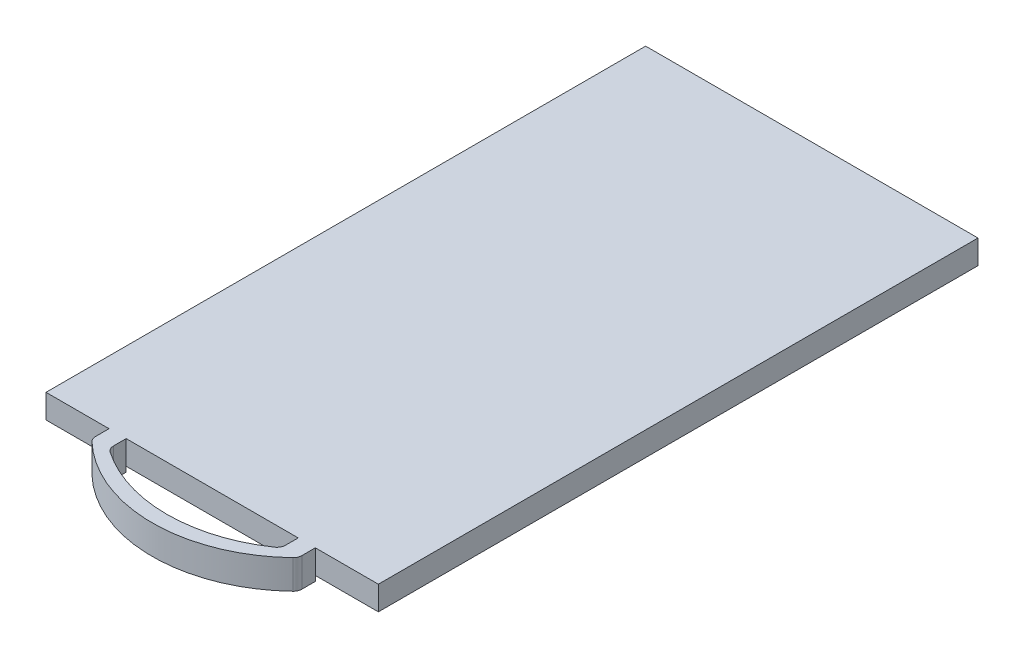
ISO-10303-21;
HEADER;
FILE_DESCRIPTION(('STEP AP214'),'2;1');
FILE_NAME('part.step','',(''),(''),'','','');
FILE_SCHEMA(('AUTOMOTIVE_DESIGN { 1 0 10303 214 1 1 1 1 }'));
ENDSEC;
DATA;
#1=APPLICATION_CONTEXT('core data for automotive mechanical design processes');
#2=APPLICATION_PROTOCOL_DEFINITION('international standard','automotive_design',2000,#1);
#3=PRODUCT_CONTEXT('',#1,'mechanical');
#4=PRODUCT('Part','Part','',(#3));
#5=PRODUCT_RELATED_PRODUCT_CATEGORY('part','',(#4));
#6=PRODUCT_DEFINITION_FORMATION('','',#4);
#7=PRODUCT_DEFINITION_CONTEXT('part definition',#1,'design');
#8=PRODUCT_DEFINITION('design','',#6,#7);
#9=PRODUCT_DEFINITION_SHAPE('','',#8);
#10=(LENGTH_UNIT() NAMED_UNIT(*) SI_UNIT(.MILLI.,.METRE.));
#11=(NAMED_UNIT(*) PLANE_ANGLE_UNIT() SI_UNIT($,.RADIAN.));
#12=(NAMED_UNIT(*) SI_UNIT($,.STERADIAN.) SOLID_ANGLE_UNIT());
#13=UNCERTAINTY_MEASURE_WITH_UNIT(LENGTH_MEASURE(1.E-05),#10,'distance_accuracy_value','');
#14=(GEOMETRIC_REPRESENTATION_CONTEXT(3) GLOBAL_UNCERTAINTY_ASSIGNED_CONTEXT((#13)) GLOBAL_UNIT_ASSIGNED_CONTEXT((#10,
#11,#12)) REPRESENTATION_CONTEXT('',''));
#15=CARTESIAN_POINT('',(0.,0.,0.));
#16=DIRECTION('',(0.,0.,1.));
#17=DIRECTION('',(1.,0.,0.));
#18=AXIS2_PLACEMENT_3D('',#15,#16,#17);
#19=CARTESIAN_POINT('',(0.,0.,35.));
#20=DIRECTION('',(0.,0.,-1.));
#21=DIRECTION('',(-1.,0.,0.));
#22=AXIS2_PLACEMENT_3D('',#19,#20,#21);
#23=PLANE('',#22);
#24=DIRECTION('',(-1.,0.,0.));
#25=VECTOR('',#24,1.);
#26=CARTESIAN_POINT('',(0.,1.4,35.));
#27=LINE('',#26,#25);
#28=CARTESIAN_POINT('',(14.7207972893961,1.4,35.));
#29=VERTEX_POINT('',#28);
#30=CARTESIAN_POINT('',(4.67920271060385,1.4,35.));
#31=VERTEX_POINT('',#30);
#32=EDGE_CURVE('E47',#29,#31,#27,.T.);
#33=ORIENTED_EDGE('',*,*,#32,.T.);
#34=DIRECTION('',(0.,-1.,0.));
#35=VECTOR('',#34,1.);
#36=CARTESIAN_POINT('',(4.67920271060385,0.,35.));
#37=LINE('',#36,#35);
#38=CARTESIAN_POINT('',(4.67920271060385,0.,35.));
#39=VERTEX_POINT('',#38);
#40=EDGE_CURVE('E11',#31,#39,#37,.T.);
#41=ORIENTED_EDGE('',*,*,#40,.T.);
#42=DIRECTION('',(1.,0.,0.));
#43=VECTOR('',#42,1.);
#44=CARTESIAN_POINT('',(19.4,0.,35.));
#45=LINE('',#44,#43);
#46=CARTESIAN_POINT('',(14.7207972893961,0.,35.));
#47=VERTEX_POINT('',#46);
#48=EDGE_CURVE('E303',#39,#47,#45,.T.);
#49=ORIENTED_EDGE('',*,*,#48,.T.);
#50=DIRECTION('',(0.,1.,0.));
#51=VECTOR('',#50,1.);
#52=CARTESIAN_POINT('',(14.7207972893961,0.,35.));
#53=LINE('',#52,#51);
#54=EDGE_CURVE('E41',#47,#29,#53,.T.);
#55=ORIENTED_EDGE('',*,*,#54,.T.);
#56=EDGE_LOOP('',(#33,#41,#49,#55));
#57=FACE_BOUND('',#56,.T.);
#58=ADVANCED_FACE('F33',(#57),#23,.F.);
#59=CARTESIAN_POINT('',(19.4,1.4,35.));
#60=VERTEX_POINT('',#59);
#61=CARTESIAN_POINT('',(15.7207972893962,1.4,35.));
#62=VERTEX_POINT('',#61);
#63=EDGE_CURVE('E55',#60,#62,#27,.T.);
#64=ORIENTED_EDGE('',*,*,#63,.T.);
#65=DIRECTION('',(0.,-1.,0.));
#66=VECTOR('',#65,1.);
#67=CARTESIAN_POINT('',(15.7207972893961,0.,35.));
#68=LINE('',#67,#66);
#69=CARTESIAN_POINT('',(15.7207972893961,0.,35.));
#70=VERTEX_POINT('',#69);
#71=EDGE_CURVE('E298',#62,#70,#68,.T.);
#72=ORIENTED_EDGE('',*,*,#71,.T.);
#73=CARTESIAN_POINT('',(19.4,0.,35.));
#74=VERTEX_POINT('',#73);
#75=EDGE_CURVE('E271',#70,#74,#45,.T.);
#76=ORIENTED_EDGE('',*,*,#75,.T.);
#77=DIRECTION('',(0.,1.,0.));
#78=VECTOR('',#77,1.);
#79=CARTESIAN_POINT('',(19.4,1.4,35.));
#80=LINE('',#79,#78);
#81=EDGE_CURVE('E269',#74,#60,#80,.T.);
#82=ORIENTED_EDGE('',*,*,#81,.T.);
#83=EDGE_LOOP('',(#64,#72,#76,#82));
#84=FACE_BOUND('',#83,.T.);
#85=ADVANCED_FACE('F328',(#84),#23,.F.);
#86=CARTESIAN_POINT('',(19.4,0.,35.));
#87=DIRECTION('',(0.,1.,0.));
#88=DIRECTION('',(-1.,0.,0.));
#89=AXIS2_PLACEMENT_3D('',#86,#87,#88);
#90=PLANE('',#89);
#91=DIRECTION('',(1.,0.,0.));
#92=VECTOR('',#91,1.);
#93=CARTESIAN_POINT('',(19.4,0.,0.));
#94=LINE('',#93,#92);
#95=CARTESIAN_POINT('',(0.,0.,0.));
#96=VERTEX_POINT('',#95);
#97=CARTESIAN_POINT('',(19.4,0.,0.));
#98=VERTEX_POINT('',#97);
#99=EDGE_CURVE('E244',#96,#98,#94,.T.);
#100=ORIENTED_EDGE('',*,*,#99,.T.);
#101=DIRECTION('',(0.,0.,-1.));
#102=VECTOR('',#101,1.);
#103=CARTESIAN_POINT('',(19.4,0.,35.));
#104=LINE('',#103,#102);
#105=EDGE_CURVE('E294',#74,#98,#104,.T.);
#106=ORIENTED_EDGE('',*,*,#105,.F.);
#107=ORIENTED_EDGE('',*,*,#75,.F.);
#108=EDGE_CURVE('E323',#47,#70,#45,.T.);
#109=ORIENTED_EDGE('',*,*,#108,.F.);
#110=ORIENTED_EDGE('',*,*,#48,.F.);
#111=CARTESIAN_POINT('',(3.67920271060385,0.,35.));
#112=VERTEX_POINT('',#111);
#113=EDGE_CURVE('E270',#112,#39,#45,.T.);
#114=ORIENTED_EDGE('',*,*,#113,.F.);
#115=CARTESIAN_POINT('',(0.,0.,35.));
#116=VERTEX_POINT('',#115);
#117=EDGE_CURVE('E266',#116,#112,#45,.T.);
#118=ORIENTED_EDGE('',*,*,#117,.F.);
#119=DIRECTION('',(0.,0.,-1.));
#120=VECTOR('',#119,1.);
#121=CARTESIAN_POINT('',(0.,0.,35.));
#122=LINE('',#121,#120);
#123=EDGE_CURVE('E277',#116,#96,#122,.T.);
#124=ORIENTED_EDGE('',*,*,#123,.T.);
#125=EDGE_LOOP('',(#100,#106,#107,#109,#110,#114,#118,#124));
#126=FACE_BOUND('',#125,.T.);
#127=ADVANCED_FACE('F35',(#126),#90,.F.);
#128=CARTESIAN_POINT('',(19.4,1.4,35.));
#129=DIRECTION('',(-1.,0.,0.));
#130=DIRECTION('',(0.,0.,1.));
#131=AXIS2_PLACEMENT_3D('',#128,#129,#130);
#132=PLANE('',#131);
#133=DIRECTION('',(0.,1.,0.));
#134=VECTOR('',#133,1.);
#135=CARTESIAN_POINT('',(19.4,1.4,0.));
#136=LINE('',#135,#134);
#137=CARTESIAN_POINT('',(19.4,1.4,0.));
#138=VERTEX_POINT('',#137);
#139=EDGE_CURVE('E280',#98,#138,#136,.T.);
#140=ORIENTED_EDGE('',*,*,#139,.T.);
#141=DIRECTION('',(0.,0.,-1.));
#142=VECTOR('',#141,1.);
#143=CARTESIAN_POINT('',(19.4,1.4,35.));
#144=LINE('',#143,#142);
#145=EDGE_CURVE('E291',#60,#138,#144,.T.);
#146=ORIENTED_EDGE('',*,*,#145,.F.);
#147=ORIENTED_EDGE('',*,*,#81,.F.);
#148=ORIENTED_EDGE('',*,*,#105,.T.);
#149=EDGE_LOOP('',(#140,#146,#147,#148));
#150=FACE_BOUND('',#149,.T.);
#151=ADVANCED_FACE('F332',(#150),#132,.F.);
#152=CARTESIAN_POINT('',(0.,1.4,35.));
#153=DIRECTION('',(0.,-1.,0.));
#154=DIRECTION('',(0.,0.,-1.));
#155=AXIS2_PLACEMENT_3D('',#152,#153,#154);
#156=PLANE('',#155);
#157=CARTESIAN_POINT('',(3.67920271060385,1.4,35.));
#158=VERTEX_POINT('',#157);
#159=CARTESIAN_POINT('',(0.,1.4,35.));
#160=VERTEX_POINT('',#159);
#161=EDGE_CURVE('E273',#158,#160,#27,.T.);
#162=ORIENTED_EDGE('',*,*,#161,.F.);
#163=DIRECTION('',(0.,0.,1.));
#164=VECTOR('',#163,1.);
#165=CARTESIAN_POINT('',(3.67920271060385,1.4,35.));
#166=LINE('',#165,#164);
#167=CARTESIAN_POINT('',(3.67920271060385,1.4,35.7897147848056));
#168=VERTEX_POINT('',#167);
#169=EDGE_CURVE('E217',#158,#168,#166,.T.);
#170=ORIENTED_EDGE('',*,*,#169,.T.);
#171=CARTESIAN_POINT('',(4.17920271060385,1.4,35.7897147848056));
#172=DIRECTION('',(0.,1.,0.));
#173=DIRECTION('',(0.,0.,1.));
#174=AXIS2_PLACEMENT_3D('',#171,#172,#173);
#175=CIRCLE('',#174,0.500000000000006);
#176=CARTESIAN_POINT('',(3.83415288001659,1.4,36.1515719588559));
#177=VERTEX_POINT('',#176);
#178=EDGE_CURVE('E220',#168,#177,#175,.T.);
#179=ORIENTED_EDGE('',*,*,#178,.T.);
#180=CARTESIAN_POINT('',(9.7,1.4,30.));
#181=DIRECTION('',(0.,1.,0.));
#182=DIRECTION('',(0.,0.,1.));
#183=AXIS2_PLACEMENT_3D('',#180,#181,#182);
#184=CIRCLE('',#183,8.50000000000001);
#185=CARTESIAN_POINT('',(15.5658471199834,1.4,36.1515719588559));
#186=VERTEX_POINT('',#185);
#187=EDGE_CURVE('E223',#177,#186,#184,.T.);
#188=ORIENTED_EDGE('',*,*,#187,.T.);
#189=CARTESIAN_POINT('',(15.2207972893961,1.4,35.7897147848056));
#190=DIRECTION('',(0.,1.,0.));
#191=DIRECTION('',(0.,0.,-1.));
#192=AXIS2_PLACEMENT_3D('',#189,#190,#191);
#193=CIRCLE('',#192,0.500000000000004);
#194=CARTESIAN_POINT('',(15.7207972893962,1.4,35.7897147848056));
#195=VERTEX_POINT('',#194);
#196=EDGE_CURVE('E226',#186,#195,#193,.T.);
#197=ORIENTED_EDGE('',*,*,#196,.T.);
#198=DIRECTION('',(0.,0.,-1.));
#199=VECTOR('',#198,1.);
#200=CARTESIAN_POINT('',(15.7207972893961,1.4,35.));
#201=LINE('',#200,#199);
#202=EDGE_CURVE('E229',#195,#62,#201,.T.);
#203=ORIENTED_EDGE('',*,*,#202,.T.);
#204=ORIENTED_EDGE('',*,*,#63,.F.);
#205=ORIENTED_EDGE('',*,*,#145,.T.);
#206=DIRECTION('',(-1.,0.,0.));
#207=VECTOR('',#206,1.);
#208=CARTESIAN_POINT('',(0.,1.4,0.));
#209=LINE('',#208,#207);
#210=CARTESIAN_POINT('',(0.,1.4,0.));
#211=VERTEX_POINT('',#210);
#212=EDGE_CURVE('E282',#138,#211,#209,.T.);
#213=ORIENTED_EDGE('',*,*,#212,.T.);
#214=DIRECTION('',(0.,0.,-1.));
#215=VECTOR('',#214,1.);
#216=CARTESIAN_POINT('',(0.,1.4,35.));
#217=LINE('',#216,#215);
#218=EDGE_CURVE('E288',#160,#211,#217,.T.);
#219=ORIENTED_EDGE('',*,*,#218,.F.);
#220=EDGE_LOOP('',(#162,#170,#179,#188,#197,#203,#204,#205,#213,#219));
#221=FACE_BOUND('',#220,.T.);
#222=DIRECTION('',(0.,0.,-1.));
#223=VECTOR('',#222,1.);
#224=CARTESIAN_POINT('',(4.67920271060385,1.4,35.));
#225=LINE('',#224,#223);
#226=CARTESIAN_POINT('',(4.67920271060385,1.4,35.7414936736857));
#227=VERTEX_POINT('',#226);
#228=EDGE_CURVE('E185',#227,#31,#225,.T.);
#229=ORIENTED_EDGE('',*,*,#228,.T.);
#230=ORIENTED_EDGE('',*,*,#32,.F.);
#231=DIRECTION('',(0.,0.,1.));
#232=VECTOR('',#231,1.);
#233=CARTESIAN_POINT('',(14.7207972893961,1.4,35.));
#234=LINE('',#233,#232);
#235=CARTESIAN_POINT('',(14.7207972893961,1.4,35.7414936736857));
#236=VERTEX_POINT('',#235);
#237=EDGE_CURVE('E232',#29,#236,#234,.T.);
#238=ORIENTED_EDGE('',*,*,#237,.T.);
#239=CARTESIAN_POINT('',(14.2207972893961,1.4,35.7414936736857));
#240=DIRECTION('',(0.,-1.,0.));
#241=DIRECTION('',(0.,0.,-1.));
#242=AXIS2_PLACEMENT_3D('',#239,#240,#241);
#243=CIRCLE('',#242,0.500000000000005);
#244=CARTESIAN_POINT('',(14.5033471199834,1.4,36.1540049986637));
#245=VERTEX_POINT('',#244);
#246=EDGE_CURVE('E235',#236,#245,#243,.T.);
#247=ORIENTED_EDGE('',*,*,#246,.T.);
#248=CARTESIAN_POINT('',(9.7,1.4,29.1413124740376));
#249=DIRECTION('',(0.,-1.,0.));
#250=DIRECTION('',(0.,0.,1.));
#251=AXIS2_PLACEMENT_3D('',#248,#249,#250);
#252=CIRCLE('',#251,8.50000000000001);
#253=CARTESIAN_POINT('',(4.89665288001659,1.4,36.1540049986637));
#254=VERTEX_POINT('',#253);
#255=EDGE_CURVE('E238',#245,#254,#252,.T.);
#256=ORIENTED_EDGE('',*,*,#255,.T.);
#257=CARTESIAN_POINT('',(5.17920271060385,1.4,35.7414936736857));
#258=DIRECTION('',(0.,-1.,0.));
#259=DIRECTION('',(0.,0.,1.));
#260=AXIS2_PLACEMENT_3D('',#257,#258,#259);
#261=CIRCLE('',#260,0.500000000000003);
#262=EDGE_CURVE('E188',#254,#227,#261,.T.);
#263=ORIENTED_EDGE('',*,*,#262,.T.);
#264=EDGE_LOOP('',(#229,#230,#238,#247,#256,#263));
#265=FACE_BOUND('',#264,.T.);
#266=ADVANCED_FACE('F308',(#221,#265),#156,.F.);
#267=CARTESIAN_POINT('',(0.,0.,35.));
#268=DIRECTION('',(1.,0.,0.));
#269=DIRECTION('',(0.,0.,-1.));
#270=AXIS2_PLACEMENT_3D('',#267,#268,#269);
#271=PLANE('',#270);
#272=DIRECTION('',(0.,-1.,0.));
#273=VECTOR('',#272,1.);
#274=CARTESIAN_POINT('',(0.,0.,0.));
#275=LINE('',#274,#273);
#276=EDGE_CURVE('E284',#211,#96,#275,.T.);
#277=ORIENTED_EDGE('',*,*,#276,.T.);
#278=ORIENTED_EDGE('',*,*,#123,.F.);
#279=DIRECTION('',(0.,-1.,0.));
#280=VECTOR('',#279,1.);
#281=CARTESIAN_POINT('',(0.,0.,35.));
#282=LINE('',#281,#280);
#283=EDGE_CURVE('E275',#160,#116,#282,.T.);
#284=ORIENTED_EDGE('',*,*,#283,.F.);
#285=ORIENTED_EDGE('',*,*,#218,.T.);
#286=EDGE_LOOP('',(#277,#278,#284,#285));
#287=FACE_BOUND('',#286,.T.);
#288=ADVANCED_FACE('F319',(#287),#271,.F.);
#289=ORIENTED_EDGE('',*,*,#117,.T.);
#290=DIRECTION('',(0.,1.,0.));
#291=VECTOR('',#290,1.);
#292=CARTESIAN_POINT('',(3.67920271060385,0.,35.));
#293=LINE('',#292,#291);
#294=EDGE_CURVE('E164',#112,#158,#293,.T.);
#295=ORIENTED_EDGE('',*,*,#294,.T.);
#296=ORIENTED_EDGE('',*,*,#161,.T.);
#297=ORIENTED_EDGE('',*,*,#283,.T.);
#298=EDGE_LOOP('',(#289,#295,#296,#297));
#299=FACE_BOUND('',#298,.T.);
#300=ADVANCED_FACE('F312',(#299),#23,.F.);
#301=CARTESIAN_POINT('',(0.,0.,0.));
#302=DIRECTION('',(0.,0.,-1.));
#303=DIRECTION('',(-1.,0.,0.));
#304=AXIS2_PLACEMENT_3D('',#301,#302,#303);
#305=PLANE('',#304);
#306=ORIENTED_EDGE('',*,*,#99,.F.);
#307=ORIENTED_EDGE('',*,*,#276,.F.);
#308=ORIENTED_EDGE('',*,*,#212,.F.);
#309=ORIENTED_EDGE('',*,*,#139,.F.);
#310=EDGE_LOOP('',(#306,#307,#308,#309));
#311=FACE_BOUND('',#310,.T.);
#312=ADVANCED_FACE('F334',(#311),#305,.T.);
#313=CARTESIAN_POINT('',(3.67920271060385,-0.3,35.));
#314=DIRECTION('',(0.,0.,-1.));
#315=DIRECTION('',(-1.,0.,0.));
#316=AXIS2_PLACEMENT_3D('',#313,#314,#315);
#317=PLANE('',#316);
#318=ORIENTED_EDGE('',*,*,#113,.T.);
#319=DIRECTION('',(0.,1.,0.));
#320=VECTOR('',#319,1.);
#321=CARTESIAN_POINT('',(4.67920271060385,-0.3,35.));
#322=LINE('',#321,#320);
#323=CARTESIAN_POINT('',(4.67920271060385,-0.3,35.));
#324=VERTEX_POINT('',#323);
#325=EDGE_CURVE('E184',#324,#39,#322,.T.);
#326=ORIENTED_EDGE('',*,*,#325,.F.);
#327=DIRECTION('',(-1.,0.,0.));
#328=VECTOR('',#327,1.);
#329=CARTESIAN_POINT('',(3.67920271060385,-0.3,35.));
#330=LINE('',#329,#328);
#331=CARTESIAN_POINT('',(3.67920271060385,-0.3,35.));
#332=VERTEX_POINT('',#331);
#333=EDGE_CURVE('E176',#324,#332,#330,.T.);
#334=ORIENTED_EDGE('',*,*,#333,.T.);
#335=DIRECTION('',(0.,1.,0.));
#336=VECTOR('',#335,1.);
#337=CARTESIAN_POINT('',(3.67920271060385,-0.3,35.));
#338=LINE('',#337,#336);
#339=EDGE_CURVE('E158',#332,#112,#338,.T.);
#340=ORIENTED_EDGE('',*,*,#339,.T.);
#341=EDGE_LOOP('',(#318,#326,#334,#340));
#342=FACE_BOUND('',#341,.T.);
#343=ADVANCED_FACE('F182',(#342),#317,.T.);
#344=CARTESIAN_POINT('',(15.7207972893961,-0.3,35.));
#345=DIRECTION('',(0.,0.,-1.));
#346=DIRECTION('',(-1.,0.,0.));
#347=AXIS2_PLACEMENT_3D('',#344,#345,#346);
#348=PLANE('',#347);
#349=ORIENTED_EDGE('',*,*,#108,.T.);
#350=DIRECTION('',(0.,1.,0.));
#351=VECTOR('',#350,1.);
#352=CARTESIAN_POINT('',(15.7207972893961,-0.3,35.));
#353=LINE('',#352,#351);
#354=CARTESIAN_POINT('',(15.7207972893961,-0.3,35.));
#355=VERTEX_POINT('',#354);
#356=EDGE_CURVE('E256',#355,#70,#353,.T.);
#357=ORIENTED_EDGE('',*,*,#356,.F.);
#358=DIRECTION('',(-1.,0.,0.));
#359=VECTOR('',#358,1.);
#360=CARTESIAN_POINT('',(15.7207972893961,-0.3,35.));
#361=LINE('',#360,#359);
#362=CARTESIAN_POINT('',(14.7207972893961,-0.3,35.));
#363=VERTEX_POINT('',#362);
#364=EDGE_CURVE('E201',#355,#363,#361,.T.);
#365=ORIENTED_EDGE('',*,*,#364,.T.);
#366=DIRECTION('',(0.,1.,0.));
#367=VECTOR('',#366,1.);
#368=CARTESIAN_POINT('',(14.7207972893961,-0.3,35.));
#369=LINE('',#368,#367);
#370=EDGE_CURVE('E253',#363,#47,#369,.T.);
#371=ORIENTED_EDGE('',*,*,#370,.T.);
#372=EDGE_LOOP('',(#349,#357,#365,#371));
#373=FACE_BOUND('',#372,.T.);
#374=ADVANCED_FACE('F341',(#373),#348,.T.);
#375=CARTESIAN_POINT('',(4.67920271060385,-0.3,35.));
#376=DIRECTION('',(1.,0.,0.));
#377=DIRECTION('',(0.,0.,-1.));
#378=AXIS2_PLACEMENT_3D('',#375,#376,#377);
#379=PLANE('',#378);
#380=ORIENTED_EDGE('',*,*,#228,.F.);
#381=DIRECTION('',(0.,1.,0.));
#382=VECTOR('',#381,1.);
#383=CARTESIAN_POINT('',(4.67920271060385,-0.3,35.7414936736857));
#384=LINE('',#383,#382);
#385=CARTESIAN_POINT('',(4.67920271060385,-0.3,35.7414936736857));
#386=VERTEX_POINT('',#385);
#387=EDGE_CURVE('E245',#386,#227,#384,.T.);
#388=ORIENTED_EDGE('',*,*,#387,.F.);
#389=DIRECTION('',(0.,0.,-1.));
#390=VECTOR('',#389,1.);
#391=CARTESIAN_POINT('',(4.67920271060385,-0.3,35.));
#392=LINE('',#391,#390);
#393=EDGE_CURVE('E169',#386,#324,#392,.T.);
#394=ORIENTED_EDGE('',*,*,#393,.T.);
#395=ORIENTED_EDGE('',*,*,#325,.T.);
#396=ORIENTED_EDGE('',*,*,#40,.F.);
#397=EDGE_LOOP('',(#380,#388,#394,#395,#396));
#398=FACE_BOUND('',#397,.T.);
#399=ADVANCED_FACE('F355',(#398),#379,.T.);
#400=CARTESIAN_POINT('',(5.17920271060385,-0.3,35.7414936736857));
#401=DIRECTION('',(0.,1.,0.));
#402=DIRECTION('',(0.,0.,1.));
#403=AXIS2_PLACEMENT_3D('',#400,#401,#402);
#404=CYLINDRICAL_SURFACE('',#403,0.500000000000003);
#405=ORIENTED_EDGE('',*,*,#262,.F.);
#406=DIRECTION('',(0.,1.,0.));
#407=VECTOR('',#406,1.);
#408=CARTESIAN_POINT('',(4.89665288001659,-0.3,36.1540049986637));
#409=LINE('',#408,#407);
#410=CARTESIAN_POINT('',(4.89665288001659,-0.3,36.1540049986637));
#411=VERTEX_POINT('',#410);
#412=EDGE_CURVE('E247',#411,#254,#409,.T.);
#413=ORIENTED_EDGE('',*,*,#412,.F.);
#414=CARTESIAN_POINT('',(5.17920271060385,-0.3,35.7414936736857));
#415=DIRECTION('',(0.,-1.,0.));
#416=DIRECTION('',(0.,0.,1.));
#417=AXIS2_PLACEMENT_3D('',#414,#415,#416);
#418=CIRCLE('',#417,0.500000000000003);
#419=EDGE_CURVE('E213',#411,#386,#418,.T.);
#420=ORIENTED_EDGE('',*,*,#419,.T.);
#421=ORIENTED_EDGE('',*,*,#387,.T.);
#422=EDGE_LOOP('',(#405,#413,#420,#421));
#423=FACE_BOUND('',#422,.T.);
#424=ADVANCED_FACE('F356',(#423),#404,.F.);
#425=CARTESIAN_POINT('',(9.7,-0.3,29.1413124740376));
#426=DIRECTION('',(0.,1.,0.));
#427=DIRECTION('',(0.,0.,1.));
#428=AXIS2_PLACEMENT_3D('',#425,#426,#427);
#429=CYLINDRICAL_SURFACE('',#428,8.50000000000001);
#430=ORIENTED_EDGE('',*,*,#255,.F.);
#431=DIRECTION('',(0.,1.,0.));
#432=VECTOR('',#431,1.);
#433=CARTESIAN_POINT('',(14.5033471199834,-0.3,36.1540049986637));
#434=LINE('',#433,#432);
#435=CARTESIAN_POINT('',(14.5033471199834,-0.3,36.1540049986637));
#436=VERTEX_POINT('',#435);
#437=EDGE_CURVE('E249',#436,#245,#434,.T.);
#438=ORIENTED_EDGE('',*,*,#437,.F.);
#439=CARTESIAN_POINT('',(9.7,-0.3,29.1413124740376));
#440=DIRECTION('',(0.,-1.,0.));
#441=DIRECTION('',(0.,0.,1.));
#442=AXIS2_PLACEMENT_3D('',#439,#440,#441);
#443=CIRCLE('',#442,8.50000000000001);
#444=EDGE_CURVE('E210',#436,#411,#443,.T.);
#445=ORIENTED_EDGE('',*,*,#444,.T.);
#446=ORIENTED_EDGE('',*,*,#412,.T.);
#447=EDGE_LOOP('',(#430,#438,#445,#446));
#448=FACE_BOUND('',#447,.T.);
#449=ADVANCED_FACE('F351',(#448),#429,.F.);
#450=CARTESIAN_POINT('',(14.2207972893961,-0.3,35.7414936736857));
#451=DIRECTION('',(0.,1.,0.));
#452=DIRECTION('',(0.,0.,1.));
#453=AXIS2_PLACEMENT_3D('',#450,#451,#452);
#454=CYLINDRICAL_SURFACE('',#453,0.500000000000005);
#455=ORIENTED_EDGE('',*,*,#246,.F.);
#456=DIRECTION('',(0.,1.,0.));
#457=VECTOR('',#456,1.);
#458=CARTESIAN_POINT('',(14.7207972893961,-0.3,35.7414936736857));
#459=LINE('',#458,#457);
#460=CARTESIAN_POINT('',(14.7207972893961,-0.3,35.7414936736857));
#461=VERTEX_POINT('',#460);
#462=EDGE_CURVE('E251',#461,#236,#459,.T.);
#463=ORIENTED_EDGE('',*,*,#462,.F.);
#464=CARTESIAN_POINT('',(14.2207972893961,-0.3,35.7414936736857));
#465=DIRECTION('',(0.,-1.,0.));
#466=DIRECTION('',(0.,0.,-1.));
#467=AXIS2_PLACEMENT_3D('',#464,#465,#466);
#468=CIRCLE('',#467,0.500000000000005);
#469=EDGE_CURVE('E207',#461,#436,#468,.T.);
#470=ORIENTED_EDGE('',*,*,#469,.T.);
#471=ORIENTED_EDGE('',*,*,#437,.T.);
#472=EDGE_LOOP('',(#455,#463,#470,#471));
#473=FACE_BOUND('',#472,.T.);
#474=ADVANCED_FACE('F348',(#473),#454,.F.);
#475=CARTESIAN_POINT('',(14.7207972893961,-0.3,35.));
#476=DIRECTION('',(-1.,0.,0.));
#477=DIRECTION('',(0.,0.,1.));
#478=AXIS2_PLACEMENT_3D('',#475,#476,#477);
#479=PLANE('',#478);
#480=ORIENTED_EDGE('',*,*,#237,.F.);
#481=ORIENTED_EDGE('',*,*,#54,.F.);
#482=ORIENTED_EDGE('',*,*,#370,.F.);
#483=DIRECTION('',(0.,0.,1.));
#484=VECTOR('',#483,1.);
#485=CARTESIAN_POINT('',(14.7207972893961,-0.3,35.));
#486=LINE('',#485,#484);
#487=EDGE_CURVE('E204',#363,#461,#486,.T.);
#488=ORIENTED_EDGE('',*,*,#487,.T.);
#489=ORIENTED_EDGE('',*,*,#462,.T.);
#490=EDGE_LOOP('',(#480,#481,#482,#488,#489));
#491=FACE_BOUND('',#490,.T.);
#492=ADVANCED_FACE('F305',(#491),#479,.T.);
#493=CARTESIAN_POINT('',(15.7207972893961,-0.3,35.));
#494=DIRECTION('',(1.,0.,0.));
#495=DIRECTION('',(0.,0.,-1.));
#496=AXIS2_PLACEMENT_3D('',#493,#494,#495);
#497=PLANE('',#496);
#498=ORIENTED_EDGE('',*,*,#202,.F.);
#499=DIRECTION('',(0.,1.,0.));
#500=VECTOR('',#499,1.);
#501=CARTESIAN_POINT('',(15.7207972893962,-0.3,35.7897147848056));
#502=LINE('',#501,#500);
#503=CARTESIAN_POINT('',(15.7207972893962,-0.3,35.7897147848056));
#504=VERTEX_POINT('',#503);
#505=EDGE_CURVE('E259',#504,#195,#502,.T.);
#506=ORIENTED_EDGE('',*,*,#505,.F.);
#507=DIRECTION('',(0.,0.,-1.));
#508=VECTOR('',#507,1.);
#509=CARTESIAN_POINT('',(15.7207972893961,-0.3,35.));
#510=LINE('',#509,#508);
#511=EDGE_CURVE('E198',#504,#355,#510,.T.);
#512=ORIENTED_EDGE('',*,*,#511,.T.);
#513=ORIENTED_EDGE('',*,*,#356,.T.);
#514=ORIENTED_EDGE('',*,*,#71,.F.);
#515=EDGE_LOOP('',(#498,#506,#512,#513,#514));
#516=FACE_BOUND('',#515,.T.);
#517=ADVANCED_FACE('F338',(#516),#497,.T.);
#518=CARTESIAN_POINT('',(15.2207972893961,-0.3,35.7897147848056));
#519=DIRECTION('',(0.,1.,0.));
#520=DIRECTION('',(0.,0.,1.));
#521=AXIS2_PLACEMENT_3D('',#518,#519,#520);
#522=CYLINDRICAL_SURFACE('',#521,0.500000000000004);
#523=ORIENTED_EDGE('',*,*,#196,.F.);
#524=DIRECTION('',(0.,1.,0.));
#525=VECTOR('',#524,1.);
#526=CARTESIAN_POINT('',(15.5658471199834,-0.3,36.1515719588559));
#527=LINE('',#526,#525);
#528=CARTESIAN_POINT('',(15.5658471199834,-0.3,36.1515719588559));
#529=VERTEX_POINT('',#528);
#530=EDGE_CURVE('E261',#529,#186,#527,.T.);
#531=ORIENTED_EDGE('',*,*,#530,.F.);
#532=CARTESIAN_POINT('',(15.2207972893961,-0.3,35.7897147848056));
#533=DIRECTION('',(0.,1.,0.));
#534=DIRECTION('',(0.,0.,-1.));
#535=AXIS2_PLACEMENT_3D('',#532,#533,#534);
#536=CIRCLE('',#535,0.500000000000004);
#537=EDGE_CURVE('E195',#529,#504,#536,.T.);
#538=ORIENTED_EDGE('',*,*,#537,.T.);
#539=ORIENTED_EDGE('',*,*,#505,.T.);
#540=EDGE_LOOP('',(#523,#531,#538,#539));
#541=FACE_BOUND('',#540,.T.);
#542=ADVANCED_FACE('F472',(#541),#522,.T.);
#543=CARTESIAN_POINT('',(9.7,-0.3,30.));
#544=DIRECTION('',(0.,1.,0.));
#545=DIRECTION('',(0.,0.,1.));
#546=AXIS2_PLACEMENT_3D('',#543,#544,#545);
#547=CYLINDRICAL_SURFACE('',#546,8.50000000000001);
#548=ORIENTED_EDGE('',*,*,#187,.F.);
#549=DIRECTION('',(0.,1.,0.));
#550=VECTOR('',#549,1.);
#551=CARTESIAN_POINT('',(3.83415288001659,-0.3,36.1515719588559));
#552=LINE('',#551,#550);
#553=CARTESIAN_POINT('',(3.83415288001659,-0.3,36.1515719588559));
#554=VERTEX_POINT('',#553);
#555=EDGE_CURVE('E263',#554,#177,#552,.T.);
#556=ORIENTED_EDGE('',*,*,#555,.F.);
#557=CARTESIAN_POINT('',(9.7,-0.3,30.));
#558=DIRECTION('',(0.,1.,0.));
#559=DIRECTION('',(0.,0.,1.));
#560=AXIS2_PLACEMENT_3D('',#557,#558,#559);
#561=CIRCLE('',#560,8.50000000000001);
#562=EDGE_CURVE('E192',#554,#529,#561,.T.);
#563=ORIENTED_EDGE('',*,*,#562,.T.);
#564=ORIENTED_EDGE('',*,*,#530,.T.);
#565=EDGE_LOOP('',(#548,#556,#563,#564));
#566=FACE_BOUND('',#565,.T.);
#567=ADVANCED_FACE('F480',(#566),#547,.T.);
#568=CARTESIAN_POINT('',(4.17920271060385,-0.3,35.7897147848056));
#569=DIRECTION('',(0.,1.,0.));
#570=DIRECTION('',(0.,0.,1.));
#571=AXIS2_PLACEMENT_3D('',#568,#569,#570);
#572=CYLINDRICAL_SURFACE('',#571,0.500000000000006);
#573=ORIENTED_EDGE('',*,*,#178,.F.);
#574=DIRECTION('',(0.,1.,0.));
#575=VECTOR('',#574,1.);
#576=CARTESIAN_POINT('',(3.67920271060385,-0.3,35.7897147848056));
#577=LINE('',#576,#575);
#578=CARTESIAN_POINT('',(3.67920271060385,-0.3,35.7897147848056));
#579=VERTEX_POINT('',#578);
#580=EDGE_CURVE('E168',#579,#168,#577,.T.);
#581=ORIENTED_EDGE('',*,*,#580,.F.);
#582=CARTESIAN_POINT('',(4.17920271060385,-0.3,35.7897147848056));
#583=DIRECTION('',(0.,1.,0.));
#584=DIRECTION('',(0.,0.,1.));
#585=AXIS2_PLACEMENT_3D('',#582,#583,#584);
#586=CIRCLE('',#585,0.500000000000006);
#587=EDGE_CURVE('E180',#579,#554,#586,.T.);
#588=ORIENTED_EDGE('',*,*,#587,.T.);
#589=ORIENTED_EDGE('',*,*,#555,.T.);
#590=EDGE_LOOP('',(#573,#581,#588,#589));
#591=FACE_BOUND('',#590,.T.);
#592=ADVANCED_FACE('F489',(#591),#572,.T.);
#593=CARTESIAN_POINT('',(3.67920271060385,-0.3,35.));
#594=DIRECTION('',(-1.,0.,0.));
#595=DIRECTION('',(0.,0.,1.));
#596=AXIS2_PLACEMENT_3D('',#593,#594,#595);
#597=PLANE('',#596);
#598=ORIENTED_EDGE('',*,*,#169,.F.);
#599=ORIENTED_EDGE('',*,*,#294,.F.);
#600=ORIENTED_EDGE('',*,*,#339,.F.);
#601=DIRECTION('',(0.,0.,1.));
#602=VECTOR('',#601,1.);
#603=CARTESIAN_POINT('',(3.67920271060385,-0.3,35.));
#604=LINE('',#603,#602);
#605=EDGE_CURVE('E162',#332,#579,#604,.T.);
#606=ORIENTED_EDGE('',*,*,#605,.T.);
#607=ORIENTED_EDGE('',*,*,#580,.T.);
#608=EDGE_LOOP('',(#598,#599,#600,#606,#607));
#609=FACE_BOUND('',#608,.T.);
#610=ADVANCED_FACE('F161',(#609),#597,.T.);
#611=CARTESIAN_POINT('',(5.17920271060385,-0.3,35.7414936736857));
#612=DIRECTION('',(0.,1.,0.));
#613=DIRECTION('',(0.,0.,1.));
#614=AXIS2_PLACEMENT_3D('',#611,#612,#613);
#615=PLANE('',#614);
#616=ORIENTED_EDGE('',*,*,#333,.F.);
#617=ORIENTED_EDGE('',*,*,#393,.F.);
#618=ORIENTED_EDGE('',*,*,#419,.F.);
#619=ORIENTED_EDGE('',*,*,#444,.F.);
#620=ORIENTED_EDGE('',*,*,#469,.F.);
#621=ORIENTED_EDGE('',*,*,#487,.F.);
#622=ORIENTED_EDGE('',*,*,#364,.F.);
#623=ORIENTED_EDGE('',*,*,#511,.F.);
#624=ORIENTED_EDGE('',*,*,#537,.F.);
#625=ORIENTED_EDGE('',*,*,#562,.F.);
#626=ORIENTED_EDGE('',*,*,#587,.F.);
#627=ORIENTED_EDGE('',*,*,#605,.F.);
#628=EDGE_LOOP('',(#616,#617,#618,#619,#620,#621,#622,#623,#624,#625,#626,#627));
#629=FACE_BOUND('',#628,.T.);
#630=ADVANCED_FACE('F174',(#629),#615,.F.);
#631=CLOSED_SHELL('',(#58,#85,#127,#151,#266,#288,#300,#312,#343,#374,#399,#424,#449,#474,#492,
#517,#542,#567,#592,#610,#630));
#632=MANIFOLD_SOLID_BREP('B2',#631);
#633=ADVANCED_BREP_SHAPE_REPRESENTATION('',(#18,#632),#14);
#634=SHAPE_DEFINITION_REPRESENTATION(#9,#633);
ENDSEC;
END-ISO-10303-21;
